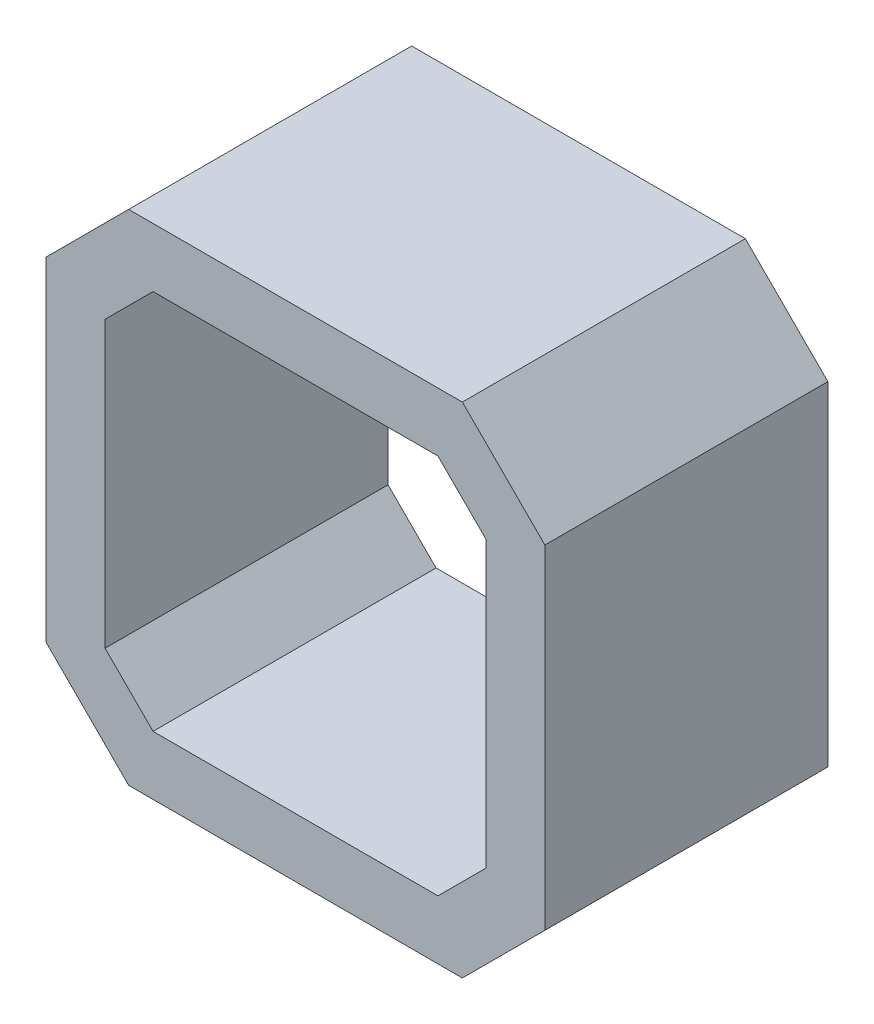
ISO-10303-21;
HEADER;
FILE_DESCRIPTION(('STEP AP214'),'2;1');
FILE_NAME('part.step','',(''),(''),'','','');
FILE_SCHEMA(('AUTOMOTIVE_DESIGN { 1 0 10303 214 1 1 1 1 }'));
ENDSEC;
DATA;
#1=APPLICATION_CONTEXT('core data for automotive mechanical design processes');
#2=APPLICATION_PROTOCOL_DEFINITION('international standard','automotive_design',2000,#1);
#3=PRODUCT_CONTEXT('',#1,'mechanical');
#4=PRODUCT('Part','Part','',(#3));
#5=PRODUCT_RELATED_PRODUCT_CATEGORY('part','',(#4));
#6=PRODUCT_DEFINITION_FORMATION('','',#4);
#7=PRODUCT_DEFINITION_CONTEXT('part definition',#1,'design');
#8=PRODUCT_DEFINITION('design','',#6,#7);
#9=PRODUCT_DEFINITION_SHAPE('','',#8);
#10=(LENGTH_UNIT() NAMED_UNIT(*) SI_UNIT(.MILLI.,.METRE.));
#11=(NAMED_UNIT(*) PLANE_ANGLE_UNIT() SI_UNIT($,.RADIAN.));
#12=(NAMED_UNIT(*) SI_UNIT($,.STERADIAN.) SOLID_ANGLE_UNIT());
#13=UNCERTAINTY_MEASURE_WITH_UNIT(LENGTH_MEASURE(1.E-05),#10,'distance_accuracy_value','');
#14=(GEOMETRIC_REPRESENTATION_CONTEXT(3) GLOBAL_UNCERTAINTY_ASSIGNED_CONTEXT((#13)) GLOBAL_UNIT_ASSIGNED_CONTEXT((#10,
#11,#12)) REPRESENTATION_CONTEXT('',''));
#15=CARTESIAN_POINT('',(0.,0.,0.));
#16=DIRECTION('',(0.,0.,1.));
#17=DIRECTION('',(1.,0.,0.));
#18=AXIS2_PLACEMENT_3D('',#15,#16,#17);
#19=CARTESIAN_POINT('',(0.,0.,24.));
#20=DIRECTION('',(0.,0.,-1.));
#21=DIRECTION('',(-1.,0.,0.));
#22=AXIS2_PLACEMENT_3D('',#19,#20,#21);
#23=PLANE('',#22);
#24=DIRECTION('',(0.,-1.,0.));
#25=VECTOR('',#24,1.);
#26=CARTESIAN_POINT('',(-21.15,-14.15,24.));
#27=LINE('',#26,#25);
#28=CARTESIAN_POINT('',(-21.15,14.15,24.));
#29=VERTEX_POINT('',#28);
#30=CARTESIAN_POINT('',(-21.15,-14.15,24.));
#31=VERTEX_POINT('',#30);
#32=EDGE_CURVE('E210',#29,#31,#27,.T.);
#33=ORIENTED_EDGE('',*,*,#32,.T.);
#34=DIRECTION('',(0.707106781186547,-0.707106781186547,0.));
#35=VECTOR('',#34,1.);
#36=CARTESIAN_POINT('',(-21.15,-14.15,24.));
#37=LINE('',#36,#35);
#38=CARTESIAN_POINT('',(-14.15,-21.15,24.));
#39=VERTEX_POINT('',#38);
#40=EDGE_CURVE('E213',#31,#39,#37,.T.);
#41=ORIENTED_EDGE('',*,*,#40,.T.);
#42=DIRECTION('',(1.,0.,0.));
#43=VECTOR('',#42,1.);
#44=CARTESIAN_POINT('',(-14.15,-21.15,24.));
#45=LINE('',#44,#43);
#46=CARTESIAN_POINT('',(14.15,-21.15,24.));
#47=VERTEX_POINT('',#46);
#48=EDGE_CURVE('E216',#39,#47,#45,.T.);
#49=ORIENTED_EDGE('',*,*,#48,.T.);
#50=DIRECTION('',(0.707106781186547,0.707106781186547,0.));
#51=VECTOR('',#50,1.);
#52=CARTESIAN_POINT('',(14.15,-21.15,24.));
#53=LINE('',#52,#51);
#54=CARTESIAN_POINT('',(21.15,-14.15,24.));
#55=VERTEX_POINT('',#54);
#56=EDGE_CURVE('E218',#47,#55,#53,.T.);
#57=ORIENTED_EDGE('',*,*,#56,.T.);
#58=DIRECTION('',(0.,1.,0.));
#59=VECTOR('',#58,1.);
#60=CARTESIAN_POINT('',(21.15,-14.15,24.));
#61=LINE('',#60,#59);
#62=CARTESIAN_POINT('',(21.15,14.15,24.));
#63=VERTEX_POINT('',#62);
#64=EDGE_CURVE('E220',#55,#63,#61,.T.);
#65=ORIENTED_EDGE('',*,*,#64,.T.);
#66=DIRECTION('',(-0.707106781186547,0.707106781186547,0.));
#67=VECTOR('',#66,1.);
#68=CARTESIAN_POINT('',(14.15,21.15,24.));
#69=LINE('',#68,#67);
#70=CARTESIAN_POINT('',(14.15,21.15,24.));
#71=VERTEX_POINT('',#70);
#72=EDGE_CURVE('E222',#63,#71,#69,.T.);
#73=ORIENTED_EDGE('',*,*,#72,.T.);
#74=DIRECTION('',(-1.,0.,0.));
#75=VECTOR('',#74,1.);
#76=CARTESIAN_POINT('',(-14.15,21.15,24.));
#77=LINE('',#76,#75);
#78=CARTESIAN_POINT('',(-14.15,21.15,24.));
#79=VERTEX_POINT('',#78);
#80=EDGE_CURVE('E224',#71,#79,#77,.T.);
#81=ORIENTED_EDGE('',*,*,#80,.T.);
#82=DIRECTION('',(-0.707106781186547,-0.707106781186547,0.));
#83=VECTOR('',#82,1.);
#84=CARTESIAN_POINT('',(-21.15,14.15,24.));
#85=LINE('',#84,#83);
#86=EDGE_CURVE('E226',#79,#29,#85,.T.);
#87=ORIENTED_EDGE('',*,*,#86,.T.);
#88=EDGE_LOOP('',(#33,#41,#49,#57,#65,#73,#81,#87));
#89=FACE_BOUND('',#88,.T.);
#90=DIRECTION('',(-0.707106781186547,-0.707106781186547,0.));
#91=VECTOR('',#90,1.);
#92=CARTESIAN_POINT('',(-16.15,12.0789321881345,24.));
#93=LINE('',#92,#91);
#94=CARTESIAN_POINT('',(-12.0789321881345,16.15,24.));
#95=VERTEX_POINT('',#94);
#96=CARTESIAN_POINT('',(-16.15,12.0789321881345,24.));
#97=VERTEX_POINT('',#96);
#98=EDGE_CURVE('E145',#95,#97,#93,.T.);
#99=ORIENTED_EDGE('',*,*,#98,.F.);
#100=DIRECTION('',(-1.,0.,0.));
#101=VECTOR('',#100,1.);
#102=CARTESIAN_POINT('',(-12.0789321881345,16.15,24.));
#103=LINE('',#102,#101);
#104=CARTESIAN_POINT('',(12.0789321881345,16.15,24.));
#105=VERTEX_POINT('',#104);
#106=EDGE_CURVE('E178',#105,#95,#103,.T.);
#107=ORIENTED_EDGE('',*,*,#106,.F.);
#108=DIRECTION('',(-0.707106781186547,0.707106781186547,0.));
#109=VECTOR('',#108,1.);
#110=CARTESIAN_POINT('',(12.0789321881345,16.15,24.));
#111=LINE('',#110,#109);
#112=CARTESIAN_POINT('',(16.15,12.0789321881345,24.));
#113=VERTEX_POINT('',#112);
#114=EDGE_CURVE('E176',#113,#105,#111,.T.);
#115=ORIENTED_EDGE('',*,*,#114,.F.);
#116=DIRECTION('',(0.,1.,0.));
#117=VECTOR('',#116,1.);
#118=CARTESIAN_POINT('',(16.15,-12.0789321881345,24.));
#119=LINE('',#118,#117);
#120=CARTESIAN_POINT('',(16.15,-12.0789321881345,24.));
#121=VERTEX_POINT('',#120);
#122=EDGE_CURVE('E174',#121,#113,#119,.T.);
#123=ORIENTED_EDGE('',*,*,#122,.F.);
#124=DIRECTION('',(0.707106781186547,0.707106781186547,0.));
#125=VECTOR('',#124,1.);
#126=CARTESIAN_POINT('',(12.0789321881345,-16.15,24.));
#127=LINE('',#126,#125);
#128=CARTESIAN_POINT('',(12.0789321881345,-16.15,24.));
#129=VERTEX_POINT('',#128);
#130=EDGE_CURVE('E172',#129,#121,#127,.T.);
#131=ORIENTED_EDGE('',*,*,#130,.F.);
#132=DIRECTION('',(1.,0.,0.));
#133=VECTOR('',#132,1.);
#134=CARTESIAN_POINT('',(-12.0789321881345,-16.15,24.));
#135=LINE('',#134,#133);
#136=CARTESIAN_POINT('',(-12.0789321881345,-16.15,24.));
#137=VERTEX_POINT('',#136);
#138=EDGE_CURVE('E168',#137,#129,#135,.T.);
#139=ORIENTED_EDGE('',*,*,#138,.F.);
#140=DIRECTION('',(0.707106781186547,-0.707106781186547,0.));
#141=VECTOR('',#140,1.);
#142=CARTESIAN_POINT('',(-16.15,-12.0789321881345,24.));
#143=LINE('',#142,#141);
#144=CARTESIAN_POINT('',(-16.15,-12.0789321881345,24.));
#145=VERTEX_POINT('',#144);
#146=EDGE_CURVE('E166',#145,#137,#143,.T.);
#147=ORIENTED_EDGE('',*,*,#146,.F.);
#148=DIRECTION('',(0.,-1.,0.));
#149=VECTOR('',#148,1.);
#150=CARTESIAN_POINT('',(-16.15,-12.0789321881345,24.));
#151=LINE('',#150,#149);
#152=EDGE_CURVE('E153',#97,#145,#151,.T.);
#153=ORIENTED_EDGE('',*,*,#152,.F.);
#154=EDGE_LOOP('',(#99,#107,#115,#123,#131,#139,#147,#153));
#155=FACE_BOUND('',#154,.T.);
#156=ADVANCED_FACE('F32',(#89,#155),#23,.F.);
#157=CARTESIAN_POINT('',(0.,0.,0.));
#158=DIRECTION('',(0.,0.,-1.));
#159=DIRECTION('',(-1.,0.,0.));
#160=AXIS2_PLACEMENT_3D('',#157,#158,#159);
#161=PLANE('',#160);
#162=DIRECTION('',(0.,-1.,0.));
#163=VECTOR('',#162,1.);
#164=CARTESIAN_POINT('',(-21.15,-14.15,0.));
#165=LINE('',#164,#163);
#166=CARTESIAN_POINT('',(-21.15,14.15,0.));
#167=VERTEX_POINT('',#166);
#168=CARTESIAN_POINT('',(-21.15,-14.15,0.));
#169=VERTEX_POINT('',#168);
#170=EDGE_CURVE('E161',#167,#169,#165,.T.);
#171=ORIENTED_EDGE('',*,*,#170,.F.);
#172=DIRECTION('',(-0.707106781186547,-0.707106781186547,0.));
#173=VECTOR('',#172,1.);
#174=CARTESIAN_POINT('',(-21.15,14.15,0.));
#175=LINE('',#174,#173);
#176=CARTESIAN_POINT('',(-14.15,21.15,0.));
#177=VERTEX_POINT('',#176);
#178=EDGE_CURVE('E214',#177,#167,#175,.T.);
#179=ORIENTED_EDGE('',*,*,#178,.F.);
#180=DIRECTION('',(-1.,0.,0.));
#181=VECTOR('',#180,1.);
#182=CARTESIAN_POINT('',(-14.15,21.15,0.));
#183=LINE('',#182,#181);
#184=CARTESIAN_POINT('',(14.15,21.15,0.));
#185=VERTEX_POINT('',#184);
#186=EDGE_CURVE('E241',#185,#177,#183,.T.);
#187=ORIENTED_EDGE('',*,*,#186,.F.);
#188=DIRECTION('',(-0.707106781186547,0.707106781186547,0.));
#189=VECTOR('',#188,1.);
#190=CARTESIAN_POINT('',(14.15,21.15,0.));
#191=LINE('',#190,#189);
#192=CARTESIAN_POINT('',(21.15,14.15,0.));
#193=VERTEX_POINT('',#192);
#194=EDGE_CURVE('E239',#193,#185,#191,.T.);
#195=ORIENTED_EDGE('',*,*,#194,.F.);
#196=DIRECTION('',(0.,1.,0.));
#197=VECTOR('',#196,1.);
#198=CARTESIAN_POINT('',(21.15,-14.15,0.));
#199=LINE('',#198,#197);
#200=CARTESIAN_POINT('',(21.15,-14.15,0.));
#201=VERTEX_POINT('',#200);
#202=EDGE_CURVE('E237',#201,#193,#199,.T.);
#203=ORIENTED_EDGE('',*,*,#202,.F.);
#204=DIRECTION('',(0.707106781186547,0.707106781186547,0.));
#205=VECTOR('',#204,1.);
#206=CARTESIAN_POINT('',(14.15,-21.15,0.));
#207=LINE('',#206,#205);
#208=CARTESIAN_POINT('',(14.15,-21.15,0.));
#209=VERTEX_POINT('',#208);
#210=EDGE_CURVE('E235',#209,#201,#207,.T.);
#211=ORIENTED_EDGE('',*,*,#210,.F.);
#212=DIRECTION('',(1.,0.,0.));
#213=VECTOR('',#212,1.);
#214=CARTESIAN_POINT('',(-14.15,-21.15,0.));
#215=LINE('',#214,#213);
#216=CARTESIAN_POINT('',(-14.15,-21.15,0.));
#217=VERTEX_POINT('',#216);
#218=EDGE_CURVE('E233',#217,#209,#215,.T.);
#219=ORIENTED_EDGE('',*,*,#218,.F.);
#220=DIRECTION('',(0.707106781186547,-0.707106781186547,0.));
#221=VECTOR('',#220,1.);
#222=CARTESIAN_POINT('',(-21.15,-14.15,0.));
#223=LINE('',#222,#221);
#224=EDGE_CURVE('E231',#169,#217,#223,.T.);
#225=ORIENTED_EDGE('',*,*,#224,.F.);
#226=EDGE_LOOP('',(#171,#179,#187,#195,#203,#211,#219,#225));
#227=FACE_BOUND('',#226,.T.);
#228=DIRECTION('',(-1.,0.,0.));
#229=VECTOR('',#228,1.);
#230=CARTESIAN_POINT('',(-12.0789321881345,16.15,0.));
#231=LINE('',#230,#229);
#232=CARTESIAN_POINT('',(12.0789321881345,16.15,0.));
#233=VERTEX_POINT('',#232);
#234=CARTESIAN_POINT('',(-12.0789321881345,16.15,0.));
#235=VERTEX_POINT('',#234);
#236=EDGE_CURVE('E154',#233,#235,#231,.T.);
#237=ORIENTED_EDGE('',*,*,#236,.T.);
#238=DIRECTION('',(-0.707106781186547,-0.707106781186547,0.));
#239=VECTOR('',#238,1.);
#240=CARTESIAN_POINT('',(-16.15,12.0789321881345,0.));
#241=LINE('',#240,#239);
#242=CARTESIAN_POINT('',(-16.15,12.0789321881345,0.));
#243=VERTEX_POINT('',#242);
#244=EDGE_CURVE('E55',#235,#243,#241,.T.);
#245=ORIENTED_EDGE('',*,*,#244,.T.);
#246=DIRECTION('',(0.,-1.,0.));
#247=VECTOR('',#246,1.);
#248=CARTESIAN_POINT('',(-16.15,-12.0789321881345,0.));
#249=LINE('',#248,#247);
#250=CARTESIAN_POINT('',(-16.15,-12.0789321881345,0.));
#251=VERTEX_POINT('',#250);
#252=EDGE_CURVE('E160',#243,#251,#249,.T.);
#253=ORIENTED_EDGE('',*,*,#252,.T.);
#254=DIRECTION('',(0.707106781186547,-0.707106781186547,0.));
#255=VECTOR('',#254,1.);
#256=CARTESIAN_POINT('',(-16.15,-12.0789321881345,0.));
#257=LINE('',#256,#255);
#258=CARTESIAN_POINT('',(-12.0789321881345,-16.15,0.));
#259=VERTEX_POINT('',#258);
#260=EDGE_CURVE('E182',#251,#259,#257,.T.);
#261=ORIENTED_EDGE('',*,*,#260,.T.);
#262=DIRECTION('',(1.,0.,0.));
#263=VECTOR('',#262,1.);
#264=CARTESIAN_POINT('',(-12.0789321881345,-16.15,0.));
#265=LINE('',#264,#263);
#266=CARTESIAN_POINT('',(12.0789321881345,-16.15,0.));
#267=VERTEX_POINT('',#266);
#268=EDGE_CURVE('E185',#259,#267,#265,.T.);
#269=ORIENTED_EDGE('',*,*,#268,.T.);
#270=DIRECTION('',(0.707106781186547,0.707106781186547,0.));
#271=VECTOR('',#270,1.);
#272=CARTESIAN_POINT('',(12.0789321881345,-16.15,0.));
#273=LINE('',#272,#271);
#274=CARTESIAN_POINT('',(16.15,-12.0789321881345,0.));
#275=VERTEX_POINT('',#274);
#276=EDGE_CURVE('E188',#267,#275,#273,.T.);
#277=ORIENTED_EDGE('',*,*,#276,.T.);
#278=DIRECTION('',(0.,1.,0.));
#279=VECTOR('',#278,1.);
#280=CARTESIAN_POINT('',(16.15,-12.0789321881345,0.));
#281=LINE('',#280,#279);
#282=CARTESIAN_POINT('',(16.15,12.0789321881345,0.));
#283=VERTEX_POINT('',#282);
#284=EDGE_CURVE('E191',#275,#283,#281,.T.);
#285=ORIENTED_EDGE('',*,*,#284,.T.);
#286=DIRECTION('',(-0.707106781186547,0.707106781186547,0.));
#287=VECTOR('',#286,1.);
#288=CARTESIAN_POINT('',(12.0789321881345,16.15,0.));
#289=LINE('',#288,#287);
#290=EDGE_CURVE('E194',#283,#233,#289,.T.);
#291=ORIENTED_EDGE('',*,*,#290,.T.);
#292=EDGE_LOOP('',(#237,#245,#253,#261,#269,#277,#285,#291));
#293=FACE_BOUND('',#292,.T.);
#294=ADVANCED_FACE('F271',(#227,#293),#161,.T.);
#295=CARTESIAN_POINT('',(-21.15,-14.15,24.));
#296=DIRECTION('',(1.,0.,0.));
#297=DIRECTION('',(0.,0.,-1.));
#298=AXIS2_PLACEMENT_3D('',#295,#296,#297);
#299=PLANE('',#298);
#300=ORIENTED_EDGE('',*,*,#170,.T.);
#301=DIRECTION('',(0.,0.,-1.));
#302=VECTOR('',#301,1.);
#303=CARTESIAN_POINT('',(-21.15,-14.15,24.));
#304=LINE('',#303,#302);
#305=EDGE_CURVE('E11',#31,#169,#304,.T.);
#306=ORIENTED_EDGE('',*,*,#305,.F.);
#307=ORIENTED_EDGE('',*,*,#32,.F.);
#308=DIRECTION('',(0.,0.,-1.));
#309=VECTOR('',#308,1.);
#310=CARTESIAN_POINT('',(-21.15,14.15,24.));
#311=LINE('',#310,#309);
#312=EDGE_CURVE('E228',#29,#167,#311,.T.);
#313=ORIENTED_EDGE('',*,*,#312,.T.);
#314=EDGE_LOOP('',(#300,#306,#307,#313));
#315=FACE_BOUND('',#314,.T.);
#316=ADVANCED_FACE('F34',(#315),#299,.F.);
#317=CARTESIAN_POINT('',(-21.15,-14.15,24.));
#318=DIRECTION('',(0.707106781186548,0.707106781186548,0.));
#319=DIRECTION('',(-0.707106781186548,0.707106781186548,0.));
#320=AXIS2_PLACEMENT_3D('',#317,#318,#319);
#321=PLANE('',#320);
#322=ORIENTED_EDGE('',*,*,#224,.T.);
#323=DIRECTION('',(0.,0.,-1.));
#324=VECTOR('',#323,1.);
#325=CARTESIAN_POINT('',(-14.15,-21.15,24.));
#326=LINE('',#325,#324);
#327=EDGE_CURVE('E40',#39,#217,#326,.T.);
#328=ORIENTED_EDGE('',*,*,#327,.F.);
#329=ORIENTED_EDGE('',*,*,#40,.F.);
#330=ORIENTED_EDGE('',*,*,#305,.T.);
#331=EDGE_LOOP('',(#322,#328,#329,#330));
#332=FACE_BOUND('',#331,.T.);
#333=ADVANCED_FACE('F288',(#332),#321,.F.);
#334=CARTESIAN_POINT('',(-14.15,-21.15,24.));
#335=DIRECTION('',(0.,1.,0.));
#336=DIRECTION('',(0.,0.,1.));
#337=AXIS2_PLACEMENT_3D('',#334,#335,#336);
#338=PLANE('',#337);
#339=ORIENTED_EDGE('',*,*,#218,.T.);
#340=DIRECTION('',(0.,0.,-1.));
#341=VECTOR('',#340,1.);
#342=CARTESIAN_POINT('',(14.15,-21.15,24.));
#343=LINE('',#342,#341);
#344=EDGE_CURVE('E258',#47,#209,#343,.T.);
#345=ORIENTED_EDGE('',*,*,#344,.F.);
#346=ORIENTED_EDGE('',*,*,#48,.F.);
#347=ORIENTED_EDGE('',*,*,#327,.T.);
#348=EDGE_LOOP('',(#339,#345,#346,#347));
#349=FACE_BOUND('',#348,.T.);
#350=ADVANCED_FACE('F265',(#349),#338,.F.);
#351=CARTESIAN_POINT('',(14.15,-21.15,24.));
#352=DIRECTION('',(-0.707106781186548,0.707106781186548,0.));
#353=DIRECTION('',(-0.707106781186548,-0.707106781186548,0.));
#354=AXIS2_PLACEMENT_3D('',#351,#352,#353);
#355=PLANE('',#354);
#356=ORIENTED_EDGE('',*,*,#210,.T.);
#357=DIRECTION('',(0.,0.,-1.));
#358=VECTOR('',#357,1.);
#359=CARTESIAN_POINT('',(21.15,-14.15,24.));
#360=LINE('',#359,#358);
#361=EDGE_CURVE('E255',#55,#201,#360,.T.);
#362=ORIENTED_EDGE('',*,*,#361,.F.);
#363=ORIENTED_EDGE('',*,*,#56,.F.);
#364=ORIENTED_EDGE('',*,*,#344,.T.);
#365=EDGE_LOOP('',(#356,#362,#363,#364));
#366=FACE_BOUND('',#365,.T.);
#367=ADVANCED_FACE('F277',(#366),#355,.F.);
#368=CARTESIAN_POINT('',(21.15,-14.15,24.));
#369=DIRECTION('',(-1.,0.,0.));
#370=DIRECTION('',(0.,0.,1.));
#371=AXIS2_PLACEMENT_3D('',#368,#369,#370);
#372=PLANE('',#371);
#373=ORIENTED_EDGE('',*,*,#202,.T.);
#374=DIRECTION('',(0.,0.,-1.));
#375=VECTOR('',#374,1.);
#376=CARTESIAN_POINT('',(21.15,14.15,24.));
#377=LINE('',#376,#375);
#378=EDGE_CURVE('E252',#63,#193,#377,.T.);
#379=ORIENTED_EDGE('',*,*,#378,.F.);
#380=ORIENTED_EDGE('',*,*,#64,.F.);
#381=ORIENTED_EDGE('',*,*,#361,.T.);
#382=EDGE_LOOP('',(#373,#379,#380,#381));
#383=FACE_BOUND('',#382,.T.);
#384=ADVANCED_FACE('F281',(#383),#372,.F.);
#385=CARTESIAN_POINT('',(14.15,21.15,24.));
#386=DIRECTION('',(-0.707106781186548,-0.707106781186548,0.));
#387=DIRECTION('',(0.707106781186548,-0.707106781186548,0.));
#388=AXIS2_PLACEMENT_3D('',#385,#386,#387);
#389=PLANE('',#388);
#390=ORIENTED_EDGE('',*,*,#194,.T.);
#391=DIRECTION('',(0.,0.,-1.));
#392=VECTOR('',#391,1.);
#393=CARTESIAN_POINT('',(14.15,21.15,24.));
#394=LINE('',#393,#392);
#395=EDGE_CURVE('E249',#71,#185,#394,.T.);
#396=ORIENTED_EDGE('',*,*,#395,.F.);
#397=ORIENTED_EDGE('',*,*,#72,.F.);
#398=ORIENTED_EDGE('',*,*,#378,.T.);
#399=EDGE_LOOP('',(#390,#396,#397,#398));
#400=FACE_BOUND('',#399,.T.);
#401=ADVANCED_FACE('F301',(#400),#389,.F.);
#402=CARTESIAN_POINT('',(-14.15,21.15,24.));
#403=DIRECTION('',(0.,-1.,0.));
#404=DIRECTION('',(0.,0.,-1.));
#405=AXIS2_PLACEMENT_3D('',#402,#403,#404);
#406=PLANE('',#405);
#407=ORIENTED_EDGE('',*,*,#186,.T.);
#408=DIRECTION('',(0.,0.,-1.));
#409=VECTOR('',#408,1.);
#410=CARTESIAN_POINT('',(-14.15,21.15,24.));
#411=LINE('',#410,#409);
#412=EDGE_CURVE('E246',#79,#177,#411,.T.);
#413=ORIENTED_EDGE('',*,*,#412,.F.);
#414=ORIENTED_EDGE('',*,*,#80,.F.);
#415=ORIENTED_EDGE('',*,*,#395,.T.);
#416=EDGE_LOOP('',(#407,#413,#414,#415));
#417=FACE_BOUND('',#416,.T.);
#418=ADVANCED_FACE('F299',(#417),#406,.F.);
#419=CARTESIAN_POINT('',(-21.15,14.15,24.));
#420=DIRECTION('',(0.707106781186548,-0.707106781186548,0.));
#421=DIRECTION('',(0.707106781186548,0.707106781186548,0.));
#422=AXIS2_PLACEMENT_3D('',#419,#420,#421);
#423=PLANE('',#422);
#424=ORIENTED_EDGE('',*,*,#178,.T.);
#425=ORIENTED_EDGE('',*,*,#312,.F.);
#426=ORIENTED_EDGE('',*,*,#86,.F.);
#427=ORIENTED_EDGE('',*,*,#412,.T.);
#428=EDGE_LOOP('',(#424,#425,#426,#427));
#429=FACE_BOUND('',#428,.T.);
#430=ADVANCED_FACE('F294',(#429),#423,.F.);
#431=CARTESIAN_POINT('',(-16.15,12.0789321881345,24.));
#432=DIRECTION('',(0.707106781186548,-0.707106781186548,0.));
#433=DIRECTION('',(0.707106781186548,0.707106781186548,0.));
#434=AXIS2_PLACEMENT_3D('',#431,#432,#433);
#435=PLANE('',#434);
#436=ORIENTED_EDGE('',*,*,#244,.F.);
#437=DIRECTION('',(0.,0.,-1.));
#438=VECTOR('',#437,1.);
#439=CARTESIAN_POINT('',(-12.0789321881345,16.15,24.));
#440=LINE('',#439,#438);
#441=EDGE_CURVE('E149',#95,#235,#440,.T.);
#442=ORIENTED_EDGE('',*,*,#441,.F.);
#443=ORIENTED_EDGE('',*,*,#98,.T.);
#444=DIRECTION('',(0.,0.,-1.));
#445=VECTOR('',#444,1.);
#446=CARTESIAN_POINT('',(-16.15,12.0789321881345,24.));
#447=LINE('',#446,#445);
#448=EDGE_CURVE('E148',#97,#243,#447,.T.);
#449=ORIENTED_EDGE('',*,*,#448,.T.);
#450=EDGE_LOOP('',(#436,#442,#443,#449));
#451=FACE_BOUND('',#450,.T.);
#452=ADVANCED_FACE('F147',(#451),#435,.T.);
#453=CARTESIAN_POINT('',(-16.15,-12.0789321881345,24.));
#454=DIRECTION('',(1.,0.,0.));
#455=DIRECTION('',(0.,0.,-1.));
#456=AXIS2_PLACEMENT_3D('',#453,#454,#455);
#457=PLANE('',#456);
#458=ORIENTED_EDGE('',*,*,#252,.F.);
#459=ORIENTED_EDGE('',*,*,#448,.F.);
#460=ORIENTED_EDGE('',*,*,#152,.T.);
#461=DIRECTION('',(0.,0.,-1.));
#462=VECTOR('',#461,1.);
#463=CARTESIAN_POINT('',(-16.15,-12.0789321881345,24.));
#464=LINE('',#463,#462);
#465=EDGE_CURVE('E162',#145,#251,#464,.T.);
#466=ORIENTED_EDGE('',*,*,#465,.T.);
#467=EDGE_LOOP('',(#458,#459,#460,#466));
#468=FACE_BOUND('',#467,.T.);
#469=ADVANCED_FACE('F157',(#468),#457,.T.);
#470=CARTESIAN_POINT('',(-16.15,-12.0789321881345,24.));
#471=DIRECTION('',(0.707106781186548,0.707106781186548,0.));
#472=DIRECTION('',(-0.707106781186548,0.707106781186548,0.));
#473=AXIS2_PLACEMENT_3D('',#470,#471,#472);
#474=PLANE('',#473);
#475=ORIENTED_EDGE('',*,*,#260,.F.);
#476=ORIENTED_EDGE('',*,*,#465,.F.);
#477=ORIENTED_EDGE('',*,*,#146,.T.);
#478=DIRECTION('',(0.,0.,-1.));
#479=VECTOR('',#478,1.);
#480=CARTESIAN_POINT('',(-12.0789321881345,-16.15,24.));
#481=LINE('',#480,#479);
#482=EDGE_CURVE('E207',#137,#259,#481,.T.);
#483=ORIENTED_EDGE('',*,*,#482,.T.);
#484=EDGE_LOOP('',(#475,#476,#477,#483));
#485=FACE_BOUND('',#484,.T.);
#486=ADVANCED_FACE('F326',(#485),#474,.T.);
#487=CARTESIAN_POINT('',(-12.0789321881345,-16.15,24.));
#488=DIRECTION('',(0.,1.,0.));
#489=DIRECTION('',(0.,0.,1.));
#490=AXIS2_PLACEMENT_3D('',#487,#488,#489);
#491=PLANE('',#490);
#492=ORIENTED_EDGE('',*,*,#268,.F.);
#493=ORIENTED_EDGE('',*,*,#482,.F.);
#494=ORIENTED_EDGE('',*,*,#138,.T.);
#495=DIRECTION('',(0.,0.,-1.));
#496=VECTOR('',#495,1.);
#497=CARTESIAN_POINT('',(12.0789321881345,-16.15,24.));
#498=LINE('',#497,#496);
#499=EDGE_CURVE('E205',#129,#267,#498,.T.);
#500=ORIENTED_EDGE('',*,*,#499,.T.);
#501=EDGE_LOOP('',(#492,#493,#494,#500));
#502=FACE_BOUND('',#501,.T.);
#503=ADVANCED_FACE('F330',(#502),#491,.T.);
#504=CARTESIAN_POINT('',(12.0789321881345,-16.15,24.));
#505=DIRECTION('',(-0.707106781186548,0.707106781186548,0.));
#506=DIRECTION('',(-0.707106781186548,-0.707106781186548,0.));
#507=AXIS2_PLACEMENT_3D('',#504,#505,#506);
#508=PLANE('',#507);
#509=ORIENTED_EDGE('',*,*,#276,.F.);
#510=ORIENTED_EDGE('',*,*,#499,.F.);
#511=ORIENTED_EDGE('',*,*,#130,.T.);
#512=DIRECTION('',(0.,0.,-1.));
#513=VECTOR('',#512,1.);
#514=CARTESIAN_POINT('',(16.15,-12.0789321881345,24.));
#515=LINE('',#514,#513);
#516=EDGE_CURVE('E203',#121,#275,#515,.T.);
#517=ORIENTED_EDGE('',*,*,#516,.T.);
#518=EDGE_LOOP('',(#509,#510,#511,#517));
#519=FACE_BOUND('',#518,.T.);
#520=ADVANCED_FACE('F336',(#519),#508,.T.);
#521=CARTESIAN_POINT('',(16.15,-12.0789321881345,24.));
#522=DIRECTION('',(-1.,0.,0.));
#523=DIRECTION('',(0.,0.,1.));
#524=AXIS2_PLACEMENT_3D('',#521,#522,#523);
#525=PLANE('',#524);
#526=ORIENTED_EDGE('',*,*,#284,.F.);
#527=ORIENTED_EDGE('',*,*,#516,.F.);
#528=ORIENTED_EDGE('',*,*,#122,.T.);
#529=DIRECTION('',(0.,0.,-1.));
#530=VECTOR('',#529,1.);
#531=CARTESIAN_POINT('',(16.15,12.0789321881345,24.));
#532=LINE('',#531,#530);
#533=EDGE_CURVE('E201',#113,#283,#532,.T.);
#534=ORIENTED_EDGE('',*,*,#533,.T.);
#535=EDGE_LOOP('',(#526,#527,#528,#534));
#536=FACE_BOUND('',#535,.T.);
#537=ADVANCED_FACE('F340',(#536),#525,.T.);
#538=CARTESIAN_POINT('',(12.0789321881345,16.15,24.));
#539=DIRECTION('',(-0.707106781186548,-0.707106781186548,0.));
#540=DIRECTION('',(0.707106781186548,-0.707106781186548,0.));
#541=AXIS2_PLACEMENT_3D('',#538,#539,#540);
#542=PLANE('',#541);
#543=ORIENTED_EDGE('',*,*,#290,.F.);
#544=ORIENTED_EDGE('',*,*,#533,.F.);
#545=ORIENTED_EDGE('',*,*,#114,.T.);
#546=DIRECTION('',(0.,0.,-1.));
#547=VECTOR('',#546,1.);
#548=CARTESIAN_POINT('',(12.0789321881345,16.15,24.));
#549=LINE('',#548,#547);
#550=EDGE_CURVE('E47',#105,#233,#549,.T.);
#551=ORIENTED_EDGE('',*,*,#550,.T.);
#552=EDGE_LOOP('',(#543,#544,#545,#551));
#553=FACE_BOUND('',#552,.T.);
#554=ADVANCED_FACE('F344',(#553),#542,.T.);
#555=CARTESIAN_POINT('',(-12.0789321881345,16.15,24.));
#556=DIRECTION('',(0.,-1.,0.));
#557=DIRECTION('',(0.,0.,-1.));
#558=AXIS2_PLACEMENT_3D('',#555,#556,#557);
#559=PLANE('',#558);
#560=ORIENTED_EDGE('',*,*,#236,.F.);
#561=ORIENTED_EDGE('',*,*,#550,.F.);
#562=ORIENTED_EDGE('',*,*,#106,.T.);
#563=ORIENTED_EDGE('',*,*,#441,.T.);
#564=EDGE_LOOP('',(#560,#561,#562,#563));
#565=FACE_BOUND('',#564,.T.);
#566=ADVANCED_FACE('F348',(#565),#559,.T.);
#567=CLOSED_SHELL('',(#156,#294,#316,#333,#350,#367,#384,#401,#418,#430,#452,#469,#486,#503,
#520,#537,#554,#566));
#568=MANIFOLD_SOLID_BREP('B2',#567);
#569=ADVANCED_BREP_SHAPE_REPRESENTATION('',(#18,#568),#14);
#570=SHAPE_DEFINITION_REPRESENTATION(#9,#569);
ENDSEC;
END-ISO-10303-21;
